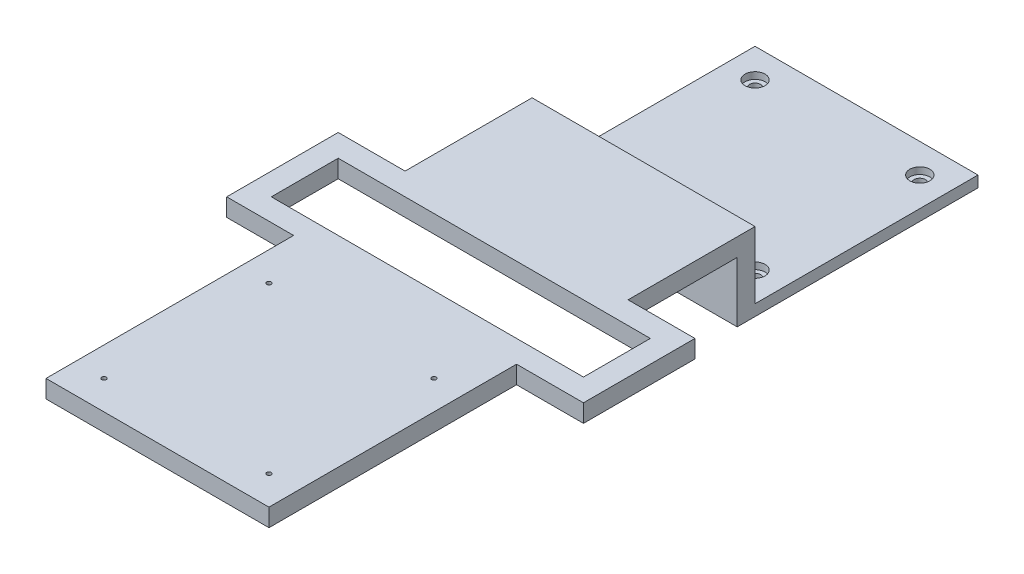
ISO-10303-21;
HEADER;
FILE_DESCRIPTION(('STEP AP214'),'2;1');
FILE_NAME('part.step','',(''),(''),'','','');
FILE_SCHEMA(('AUTOMOTIVE_DESIGN { 1 0 10303 214 1 1 1 1 }'));
ENDSEC;
DATA;
#1=APPLICATION_CONTEXT('core data for automotive mechanical design processes');
#2=APPLICATION_PROTOCOL_DEFINITION('international standard','automotive_design',2000,#1);
#3=PRODUCT_CONTEXT('',#1,'mechanical');
#4=PRODUCT('Part','Part','',(#3));
#5=PRODUCT_RELATED_PRODUCT_CATEGORY('part','',(#4));
#6=PRODUCT_DEFINITION_FORMATION('','',#4);
#7=PRODUCT_DEFINITION_CONTEXT('part definition',#1,'design');
#8=PRODUCT_DEFINITION('design','',#6,#7);
#9=PRODUCT_DEFINITION_SHAPE('','',#8);
#10=(LENGTH_UNIT() NAMED_UNIT(*) SI_UNIT(.MILLI.,.METRE.));
#11=(NAMED_UNIT(*) PLANE_ANGLE_UNIT() SI_UNIT($,.RADIAN.));
#12=(NAMED_UNIT(*) SI_UNIT($,.STERADIAN.) SOLID_ANGLE_UNIT());
#13=UNCERTAINTY_MEASURE_WITH_UNIT(LENGTH_MEASURE(1.E-05),#10,'distance_accuracy_value','');
#14=(GEOMETRIC_REPRESENTATION_CONTEXT(3) GLOBAL_UNCERTAINTY_ASSIGNED_CONTEXT((#13)) GLOBAL_UNIT_ASSIGNED_CONTEXT((#10,
#11,#12)) REPRESENTATION_CONTEXT('',''));
#15=CARTESIAN_POINT('',(0.,0.,0.));
#16=DIRECTION('',(0.,0.,1.));
#17=DIRECTION('',(1.,0.,0.));
#18=AXIS2_PLACEMENT_3D('',#15,#16,#17);
#19=CARTESIAN_POINT('',(50.,5.,-50.));
#20=DIRECTION('',(-1.,0.,0.));
#21=DIRECTION('',(0.,0.,1.));
#22=AXIS2_PLACEMENT_3D('',#19,#20,#21);
#23=PLANE('',#22);
#24=DIRECTION('',(0.,0.,-1.));
#25=VECTOR('',#24,1.);
#26=CARTESIAN_POINT('',(50.,27.,268.));
#27=LINE('',#26,#25);
#28=CARTESIAN_POINT('',(50.,27.,268.));
#29=VERTEX_POINT('',#28);
#30=CARTESIAN_POINT('',(50.,27.,156.95));
#31=VERTEX_POINT('',#30);
#32=EDGE_CURVE('E266',#29,#31,#27,.T.);
#33=ORIENTED_EDGE('',*,*,#32,.T.);
#34=DIRECTION('',(0.,1.,0.));
#35=VECTOR('',#34,1.);
#36=CARTESIAN_POINT('',(50.,5.,156.95));
#37=LINE('',#36,#35);
#38=CARTESIAN_POINT('',(50.,35.,156.95));
#39=VERTEX_POINT('',#38);
#40=EDGE_CURVE('E249',#31,#39,#37,.T.);
#41=ORIENTED_EDGE('',*,*,#40,.T.);
#42=DIRECTION('',(0.,0.,-1.));
#43=VECTOR('',#42,1.);
#44=CARTESIAN_POINT('',(50.,35.,50.));
#45=LINE('',#44,#43);
#46=CARTESIAN_POINT('',(50.,35.,268.));
#47=VERTEX_POINT('',#46);
#48=EDGE_CURVE('E280',#47,#39,#45,.T.);
#49=ORIENTED_EDGE('',*,*,#48,.F.);
#50=DIRECTION('',(0.,1.,0.));
#51=VECTOR('',#50,1.);
#52=CARTESIAN_POINT('',(50.,35.,268.));
#53=LINE('',#52,#51);
#54=EDGE_CURVE('E257',#29,#47,#53,.T.);
#55=ORIENTED_EDGE('',*,*,#54,.F.);
#56=EDGE_LOOP('',(#33,#41,#49,#55));
#57=FACE_BOUND('',#56,.T.);
#58=ADVANCED_FACE('F35',(#57),#23,.F.);
#59=CARTESIAN_POINT('',(-50.,5.,-50.));
#60=DIRECTION('',(1.,0.,0.));
#61=DIRECTION('',(0.,0.,-1.));
#62=AXIS2_PLACEMENT_3D('',#59,#60,#61);
#63=PLANE('',#62);
#64=DIRECTION('',(0.,0.,-1.));
#65=VECTOR('',#64,1.);
#66=CARTESIAN_POINT('',(-50.,35.,50.));
#67=LINE('',#66,#65);
#68=CARTESIAN_POINT('',(-50.,35.,268.));
#69=VERTEX_POINT('',#68);
#70=CARTESIAN_POINT('',(-50.,35.,156.95));
#71=VERTEX_POINT('',#70);
#72=EDGE_CURVE('E276',#69,#71,#67,.T.);
#73=ORIENTED_EDGE('',*,*,#72,.T.);
#74=DIRECTION('',(0.,-1.,0.));
#75=VECTOR('',#74,1.);
#76=CARTESIAN_POINT('',(-50.,5.,156.95));
#77=LINE('',#76,#75);
#78=CARTESIAN_POINT('',(-50.,27.,156.95));
#79=VERTEX_POINT('',#78);
#80=EDGE_CURVE('E246',#71,#79,#77,.T.);
#81=ORIENTED_EDGE('',*,*,#80,.T.);
#82=DIRECTION('',(0.,0.,-1.));
#83=VECTOR('',#82,1.);
#84=CARTESIAN_POINT('',(-50.,27.,268.));
#85=LINE('',#84,#83);
#86=CARTESIAN_POINT('',(-50.,27.,268.));
#87=VERTEX_POINT('',#86);
#88=EDGE_CURVE('E269',#87,#79,#85,.T.);
#89=ORIENTED_EDGE('',*,*,#88,.F.);
#90=DIRECTION('',(0.,-1.,0.));
#91=VECTOR('',#90,1.);
#92=CARTESIAN_POINT('',(-50.,35.,268.));
#93=LINE('',#92,#91);
#94=EDGE_CURVE('E252',#69,#87,#93,.T.);
#95=ORIENTED_EDGE('',*,*,#94,.F.);
#96=EDGE_LOOP('',(#73,#81,#89,#95));
#97=FACE_BOUND('',#96,.T.);
#98=ADVANCED_FACE('F437',(#97),#63,.F.);
#99=CARTESIAN_POINT('',(-36.95,5.,-36.95));
#100=DIRECTION('',(0.,-1.,0.));
#101=DIRECTION('',(0.,0.,-1.));
#102=AXIS2_PLACEMENT_3D('',#99,#100,#101);
#103=CYLINDRICAL_SURFACE('',#102,2.5);
#104=CARTESIAN_POINT('',(-36.95,0.,-36.95));
#105=DIRECTION('',(0.,1.,0.));
#106=DIRECTION('',(0.,0.,1.));
#107=AXIS2_PLACEMENT_3D('',#104,#105,#106);
#108=CIRCLE('',#107,2.5);
#109=CARTESIAN_POINT('',(-36.95,0.,-34.45));
#110=VERTEX_POINT('',#109);
#111=EDGE_CURVE('E331',#110,#110,#108,.T.);
#112=ORIENTED_EDGE('',*,*,#111,.F.);
#113=EDGE_LOOP('',(#112));
#114=FACE_BOUND('',#113,.T.);
#115=CARTESIAN_POINT('',(-36.95,2.,-36.95));
#116=DIRECTION('',(0.,1.,0.));
#117=DIRECTION('',(0.,0.,1.));
#118=AXIS2_PLACEMENT_3D('',#115,#116,#117);
#119=CIRCLE('',#118,2.5);
#120=CARTESIAN_POINT('',(-36.95,2.,-34.45));
#121=VERTEX_POINT('',#120);
#122=EDGE_CURVE('E39',#121,#121,#119,.T.);
#123=ORIENTED_EDGE('',*,*,#122,.T.);
#124=EDGE_LOOP('',(#123));
#125=FACE_BOUND('',#124,.T.);
#126=ADVANCED_FACE('F365',(#114,#125),#103,.F.);
#127=CARTESIAN_POINT('',(36.95,5.,-36.95));
#128=DIRECTION('',(0.,-1.,0.));
#129=DIRECTION('',(0.,0.,-1.));
#130=AXIS2_PLACEMENT_3D('',#127,#128,#129);
#131=CYLINDRICAL_SURFACE('',#130,2.5);
#132=CARTESIAN_POINT('',(36.95,0.,-36.95));
#133=DIRECTION('',(0.,1.,0.));
#134=DIRECTION('',(0.,0.,-1.));
#135=AXIS2_PLACEMENT_3D('',#132,#133,#134);
#136=CIRCLE('',#135,2.5);
#137=CARTESIAN_POINT('',(36.95,0.,-39.45));
#138=VERTEX_POINT('',#137);
#139=EDGE_CURVE('E328',#138,#138,#136,.T.);
#140=ORIENTED_EDGE('',*,*,#139,.F.);
#141=EDGE_LOOP('',(#140));
#142=FACE_BOUND('',#141,.T.);
#143=CARTESIAN_POINT('',(36.95,2.,-36.95));
#144=DIRECTION('',(0.,1.,0.));
#145=DIRECTION('',(0.,0.,1.));
#146=AXIS2_PLACEMENT_3D('',#143,#144,#145);
#147=CIRCLE('',#146,2.5);
#148=CARTESIAN_POINT('',(36.95,2.,-34.45));
#149=VERTEX_POINT('',#148);
#150=EDGE_CURVE('E358',#149,#149,#147,.T.);
#151=ORIENTED_EDGE('',*,*,#150,.T.);
#152=EDGE_LOOP('',(#151));
#153=FACE_BOUND('',#152,.T.);
#154=ADVANCED_FACE('F502',(#142,#153),#131,.F.);
#155=CARTESIAN_POINT('',(36.95,5.,36.95));
#156=DIRECTION('',(0.,-1.,0.));
#157=DIRECTION('',(0.,0.,-1.));
#158=AXIS2_PLACEMENT_3D('',#155,#156,#157);
#159=CYLINDRICAL_SURFACE('',#158,2.5);
#160=CARTESIAN_POINT('',(36.95,0.,36.95));
#161=DIRECTION('',(0.,1.,0.));
#162=DIRECTION('',(0.,0.,1.));
#163=AXIS2_PLACEMENT_3D('',#160,#161,#162);
#164=CIRCLE('',#163,2.5);
#165=CARTESIAN_POINT('',(36.95,0.,39.45));
#166=VERTEX_POINT('',#165);
#167=EDGE_CURVE('E325',#166,#166,#164,.T.);
#168=ORIENTED_EDGE('',*,*,#167,.F.);
#169=EDGE_LOOP('',(#168));
#170=FACE_BOUND('',#169,.T.);
#171=CARTESIAN_POINT('',(36.95,2.,36.95));
#172=DIRECTION('',(0.,1.,0.));
#173=DIRECTION('',(0.,0.,1.));
#174=AXIS2_PLACEMENT_3D('',#171,#172,#173);
#175=CIRCLE('',#174,2.5);
#176=CARTESIAN_POINT('',(36.95,2.,39.45));
#177=VERTEX_POINT('',#176);
#178=EDGE_CURVE('E356',#177,#177,#175,.T.);
#179=ORIENTED_EDGE('',*,*,#178,.T.);
#180=EDGE_LOOP('',(#179));
#181=FACE_BOUND('',#180,.T.);
#182=ADVANCED_FACE('F470',(#170,#181),#159,.F.);
#183=CARTESIAN_POINT('',(-36.95,5.,36.95));
#184=DIRECTION('',(0.,-1.,0.));
#185=DIRECTION('',(0.,0.,-1.));
#186=AXIS2_PLACEMENT_3D('',#183,#184,#185);
#187=CYLINDRICAL_SURFACE('',#186,2.5);
#188=CARTESIAN_POINT('',(-36.95,0.,36.95));
#189=DIRECTION('',(0.,1.,0.));
#190=DIRECTION('',(0.,0.,-1.));
#191=AXIS2_PLACEMENT_3D('',#188,#189,#190);
#192=CIRCLE('',#191,2.5);
#193=CARTESIAN_POINT('',(-36.95,0.,34.45));
#194=VERTEX_POINT('',#193);
#195=EDGE_CURVE('E322',#194,#194,#192,.T.);
#196=ORIENTED_EDGE('',*,*,#195,.F.);
#197=EDGE_LOOP('',(#196));
#198=FACE_BOUND('',#197,.T.);
#199=CARTESIAN_POINT('',(-36.95,2.,36.95));
#200=DIRECTION('',(0.,1.,0.));
#201=DIRECTION('',(0.,0.,1.));
#202=AXIS2_PLACEMENT_3D('',#199,#200,#201);
#203=CIRCLE('',#202,2.5);
#204=CARTESIAN_POINT('',(-36.95,2.,39.45));
#205=VERTEX_POINT('',#204);
#206=EDGE_CURVE('E319',#205,#205,#203,.T.);
#207=ORIENTED_EDGE('',*,*,#206,.T.);
#208=EDGE_LOOP('',(#207));
#209=FACE_BOUND('',#208,.T.);
#210=ADVANCED_FACE('F385',(#198,#209),#187,.F.);
#211=CARTESIAN_POINT('',(0.,5.,0.));
#212=DIRECTION('',(0.,1.,0.));
#213=DIRECTION('',(0.,0.,1.));
#214=AXIS2_PLACEMENT_3D('',#211,#212,#213);
#215=PLANE('',#214);
#216=CARTESIAN_POINT('',(-36.95,5.,-36.95));
#217=DIRECTION('',(0.,1.,0.));
#218=DIRECTION('',(0.,0.,1.));
#219=AXIS2_PLACEMENT_3D('',#216,#217,#218);
#220=CIRCLE('',#219,4.5);
#221=CARTESIAN_POINT('',(-36.95,5.,-32.45));
#222=VERTEX_POINT('',#221);
#223=EDGE_CURVE('E295',#222,#222,#220,.T.);
#224=ORIENTED_EDGE('',*,*,#223,.F.);
#225=EDGE_LOOP('',(#224));
#226=FACE_BOUND('',#225,.T.);
#227=CARTESIAN_POINT('',(36.95,5.,-36.95));
#228=DIRECTION('',(0.,1.,0.));
#229=DIRECTION('',(0.,0.,1.));
#230=AXIS2_PLACEMENT_3D('',#227,#228,#229);
#231=CIRCLE('',#230,4.5);
#232=CARTESIAN_POINT('',(36.95,5.,-32.45));
#233=VERTEX_POINT('',#232);
#234=EDGE_CURVE('E308',#233,#233,#231,.T.);
#235=ORIENTED_EDGE('',*,*,#234,.F.);
#236=EDGE_LOOP('',(#235));
#237=FACE_BOUND('',#236,.T.);
#238=CARTESIAN_POINT('',(36.95,5.,36.95));
#239=DIRECTION('',(0.,1.,0.));
#240=DIRECTION('',(0.,0.,1.));
#241=AXIS2_PLACEMENT_3D('',#238,#239,#240);
#242=CIRCLE('',#241,4.5);
#243=CARTESIAN_POINT('',(36.95,5.,41.45));
#244=VERTEX_POINT('',#243);
#245=EDGE_CURVE('E302',#244,#244,#242,.T.);
#246=ORIENTED_EDGE('',*,*,#245,.F.);
#247=EDGE_LOOP('',(#246));
#248=FACE_BOUND('',#247,.T.);
#249=CARTESIAN_POINT('',(-36.95,5.,36.95));
#250=DIRECTION('',(0.,1.,0.));
#251=DIRECTION('',(0.,0.,1.));
#252=AXIS2_PLACEMENT_3D('',#249,#250,#251);
#253=CIRCLE('',#252,4.5);
#254=CARTESIAN_POINT('',(-36.95,5.,41.45));
#255=VERTEX_POINT('',#254);
#256=EDGE_CURVE('E301',#255,#255,#253,.T.);
#257=ORIENTED_EDGE('',*,*,#256,.F.);
#258=EDGE_LOOP('',(#257));
#259=FACE_BOUND('',#258,.T.);
#260=DIRECTION('',(0.,0.,-1.));
#261=VECTOR('',#260,1.);
#262=CARTESIAN_POINT('',(50.,5.,-50.));
#263=LINE('',#262,#261);
#264=CARTESIAN_POINT('',(50.,5.,50.));
#265=VERTEX_POINT('',#264);
#266=CARTESIAN_POINT('',(50.,5.,-50.));
#267=VERTEX_POINT('',#266);
#268=EDGE_CURVE('E335',#265,#267,#263,.T.);
#269=ORIENTED_EDGE('',*,*,#268,.T.);
#270=DIRECTION('',(-1.,0.,0.));
#271=VECTOR('',#270,1.);
#272=CARTESIAN_POINT('',(-50.,5.,-50.));
#273=LINE('',#272,#271);
#274=CARTESIAN_POINT('',(-50.,5.,-50.));
#275=VERTEX_POINT('',#274);
#276=EDGE_CURVE('E338',#267,#275,#273,.T.);
#277=ORIENTED_EDGE('',*,*,#276,.T.);
#278=DIRECTION('',(0.,0.,1.));
#279=VECTOR('',#278,1.);
#280=CARTESIAN_POINT('',(-50.,5.,-50.));
#281=LINE('',#280,#279);
#282=CARTESIAN_POINT('',(-50.,5.,50.));
#283=VERTEX_POINT('',#282);
#284=EDGE_CURVE('E341',#275,#283,#281,.T.);
#285=ORIENTED_EDGE('',*,*,#284,.T.);
#286=DIRECTION('',(1.,0.,0.));
#287=VECTOR('',#286,1.);
#288=CARTESIAN_POINT('',(-50.,5.,50.));
#289=LINE('',#288,#287);
#290=EDGE_CURVE('E344',#283,#265,#289,.T.);
#291=ORIENTED_EDGE('',*,*,#290,.T.);
#292=EDGE_LOOP('',(#269,#277,#285,#291));
#293=FACE_BOUND('',#292,.T.);
#294=ADVANCED_FACE('F381',(#226,#237,#248,#259,#293),#215,.T.);
#295=CARTESIAN_POINT('',(0.,0.,0.));
#296=DIRECTION('',(0.,1.,0.));
#297=DIRECTION('',(0.,0.,1.));
#298=AXIS2_PLACEMENT_3D('',#295,#296,#297);
#299=PLANE('',#298);
#300=DIRECTION('',(0.,0.,-1.));
#301=VECTOR('',#300,1.);
#302=CARTESIAN_POINT('',(50.,0.,-50.));
#303=LINE('',#302,#301);
#304=CARTESIAN_POINT('',(50.,0.,58.));
#305=VERTEX_POINT('',#304);
#306=CARTESIAN_POINT('',(50.,0.,-50.));
#307=VERTEX_POINT('',#306);
#308=EDGE_CURVE('E334',#305,#307,#303,.T.);
#309=ORIENTED_EDGE('',*,*,#308,.F.);
#310=DIRECTION('',(-1.,0.,0.));
#311=VECTOR('',#310,1.);
#312=CARTESIAN_POINT('',(50.,0.,58.));
#313=LINE('',#312,#311);
#314=CARTESIAN_POINT('',(-50.,0.,58.));
#315=VERTEX_POINT('',#314);
#316=EDGE_CURVE('E283',#305,#315,#313,.T.);
#317=ORIENTED_EDGE('',*,*,#316,.T.);
#318=DIRECTION('',(0.,0.,1.));
#319=VECTOR('',#318,1.);
#320=CARTESIAN_POINT('',(-50.,0.,-50.));
#321=LINE('',#320,#319);
#322=CARTESIAN_POINT('',(-50.,0.,-50.));
#323=VERTEX_POINT('',#322);
#324=EDGE_CURVE('E339',#323,#315,#321,.T.);
#325=ORIENTED_EDGE('',*,*,#324,.F.);
#326=DIRECTION('',(-1.,0.,0.));
#327=VECTOR('',#326,1.);
#328=CARTESIAN_POINT('',(-50.,0.,-50.));
#329=LINE('',#328,#327);
#330=EDGE_CURVE('E349',#307,#323,#329,.T.);
#331=ORIENTED_EDGE('',*,*,#330,.F.);
#332=EDGE_LOOP('',(#309,#317,#325,#331));
#333=FACE_BOUND('',#332,.T.);
#334=ORIENTED_EDGE('',*,*,#111,.T.);
#335=EDGE_LOOP('',(#334));
#336=FACE_BOUND('',#335,.T.);
#337=ORIENTED_EDGE('',*,*,#139,.T.);
#338=EDGE_LOOP('',(#337));
#339=FACE_BOUND('',#338,.T.);
#340=ORIENTED_EDGE('',*,*,#167,.T.);
#341=EDGE_LOOP('',(#340));
#342=FACE_BOUND('',#341,.T.);
#343=ORIENTED_EDGE('',*,*,#195,.T.);
#344=EDGE_LOOP('',(#343));
#345=FACE_BOUND('',#344,.T.);
#346=ADVANCED_FACE('F384',(#333,#336,#339,#342,#345),#299,.F.);
#347=CARTESIAN_POINT('',(50.,35.,106.95));
#348=VERTEX_POINT('',#347);
#349=CARTESIAN_POINT('',(50.,35.,50.));
#350=VERTEX_POINT('',#349);
#351=EDGE_CURVE('E279',#348,#350,#45,.T.);
#352=ORIENTED_EDGE('',*,*,#351,.F.);
#353=DIRECTION('',(0.,-1.,0.));
#354=VECTOR('',#353,1.);
#355=CARTESIAN_POINT('',(50.,5.,106.95));
#356=LINE('',#355,#354);
#357=CARTESIAN_POINT('',(50.,27.,106.95));
#358=VERTEX_POINT('',#357);
#359=EDGE_CURVE('E243',#348,#358,#356,.T.);
#360=ORIENTED_EDGE('',*,*,#359,.T.);
#361=CARTESIAN_POINT('',(50.,27.,58.));
#362=VERTEX_POINT('',#361);
#363=EDGE_CURVE('E263',#358,#362,#27,.T.);
#364=ORIENTED_EDGE('',*,*,#363,.T.);
#365=DIRECTION('',(0.,1.,0.));
#366=VECTOR('',#365,1.);
#367=CARTESIAN_POINT('',(50.,0.,58.));
#368=LINE('',#367,#366);
#369=EDGE_CURVE('E275',#305,#362,#368,.T.);
#370=ORIENTED_EDGE('',*,*,#369,.F.);
#371=ORIENTED_EDGE('',*,*,#308,.T.);
#372=DIRECTION('',(0.,-1.,0.));
#373=VECTOR('',#372,1.);
#374=CARTESIAN_POINT('',(50.,5.,-50.));
#375=LINE('',#374,#373);
#376=EDGE_CURVE('E11',#267,#307,#375,.T.);
#377=ORIENTED_EDGE('',*,*,#376,.F.);
#378=ORIENTED_EDGE('',*,*,#268,.F.);
#379=DIRECTION('',(0.,-1.,0.));
#380=VECTOR('',#379,1.);
#381=CARTESIAN_POINT('',(50.,0.,50.));
#382=LINE('',#381,#380);
#383=EDGE_CURVE('E273',#350,#265,#382,.T.);
#384=ORIENTED_EDGE('',*,*,#383,.F.);
#385=EDGE_LOOP('',(#352,#360,#364,#370,#371,#377,#378,#384));
#386=FACE_BOUND('',#385,.T.);
#387=ADVANCED_FACE('F37',(#386),#23,.F.);
#388=CARTESIAN_POINT('',(-50.,5.,-50.));
#389=DIRECTION('',(0.,0.,1.));
#390=DIRECTION('',(1.,0.,0.));
#391=AXIS2_PLACEMENT_3D('',#388,#389,#390);
#392=PLANE('',#391);
#393=ORIENTED_EDGE('',*,*,#330,.T.);
#394=DIRECTION('',(0.,-1.,0.));
#395=VECTOR('',#394,1.);
#396=CARTESIAN_POINT('',(-50.,5.,-50.));
#397=LINE('',#396,#395);
#398=EDGE_CURVE('E44',#275,#323,#397,.T.);
#399=ORIENTED_EDGE('',*,*,#398,.F.);
#400=ORIENTED_EDGE('',*,*,#276,.F.);
#401=ORIENTED_EDGE('',*,*,#376,.T.);
#402=EDGE_LOOP('',(#393,#399,#400,#401));
#403=FACE_BOUND('',#402,.T.);
#404=ADVANCED_FACE('F400',(#403),#392,.F.);
#405=CARTESIAN_POINT('',(-50.,27.,106.95));
#406=VERTEX_POINT('',#405);
#407=CARTESIAN_POINT('',(-50.,27.,58.));
#408=VERTEX_POINT('',#407);
#409=EDGE_CURVE('E268',#406,#408,#85,.T.);
#410=ORIENTED_EDGE('',*,*,#409,.F.);
#411=DIRECTION('',(0.,1.,0.));
#412=VECTOR('',#411,1.);
#413=CARTESIAN_POINT('',(-50.,5.,106.95));
#414=LINE('',#413,#412);
#415=CARTESIAN_POINT('',(-50.,35.,106.95));
#416=VERTEX_POINT('',#415);
#417=EDGE_CURVE('E240',#406,#416,#414,.T.);
#418=ORIENTED_EDGE('',*,*,#417,.T.);
#419=CARTESIAN_POINT('',(-50.,35.,50.));
#420=VERTEX_POINT('',#419);
#421=EDGE_CURVE('E289',#416,#420,#67,.T.);
#422=ORIENTED_EDGE('',*,*,#421,.T.);
#423=DIRECTION('',(0.,-1.,0.));
#424=VECTOR('',#423,1.);
#425=CARTESIAN_POINT('',(-50.,0.,50.));
#426=LINE('',#425,#424);
#427=EDGE_CURVE('E272',#420,#283,#426,.T.);
#428=ORIENTED_EDGE('',*,*,#427,.T.);
#429=ORIENTED_EDGE('',*,*,#284,.F.);
#430=ORIENTED_EDGE('',*,*,#398,.T.);
#431=ORIENTED_EDGE('',*,*,#324,.T.);
#432=DIRECTION('',(0.,1.,0.));
#433=VECTOR('',#432,1.);
#434=CARTESIAN_POINT('',(-50.,0.,58.));
#435=LINE('',#434,#433);
#436=EDGE_CURVE('E286',#315,#408,#435,.T.);
#437=ORIENTED_EDGE('',*,*,#436,.T.);
#438=EDGE_LOOP('',(#410,#418,#422,#428,#429,#430,#431,#437));
#439=FACE_BOUND('',#438,.T.);
#440=ADVANCED_FACE('F405',(#439),#63,.F.);
#441=CARTESIAN_POINT('',(-36.95,2.,36.95));
#442=DIRECTION('',(0.,1.,0.));
#443=DIRECTION('',(0.,0.,1.));
#444=AXIS2_PLACEMENT_3D('',#441,#442,#443);
#445=CYLINDRICAL_SURFACE('',#444,4.5);
#446=CARTESIAN_POINT('',(-36.95,2.,36.95));
#447=DIRECTION('',(0.,1.,0.));
#448=DIRECTION('',(0.,0.,1.));
#449=AXIS2_PLACEMENT_3D('',#446,#447,#448);
#450=CIRCLE('',#449,4.5);
#451=CARTESIAN_POINT('',(-36.95,2.,41.45));
#452=VERTEX_POINT('',#451);
#453=EDGE_CURVE('E316',#452,#452,#450,.T.);
#454=ORIENTED_EDGE('',*,*,#453,.F.);
#455=EDGE_LOOP('',(#454));
#456=FACE_BOUND('',#455,.T.);
#457=ORIENTED_EDGE('',*,*,#256,.T.);
#458=EDGE_LOOP('',(#457));
#459=FACE_BOUND('',#458,.T.);
#460=ADVANCED_FACE('F478',(#456,#459),#445,.F.);
#461=CARTESIAN_POINT('',(-36.95,2.,36.95));
#462=DIRECTION('',(0.,1.,0.));
#463=DIRECTION('',(0.,0.,1.));
#464=AXIS2_PLACEMENT_3D('',#461,#462,#463);
#465=PLANE('',#464);
#466=ORIENTED_EDGE('',*,*,#206,.F.);
#467=EDGE_LOOP('',(#466));
#468=FACE_BOUND('',#467,.T.);
#469=ORIENTED_EDGE('',*,*,#453,.T.);
#470=EDGE_LOOP('',(#469));
#471=FACE_BOUND('',#470,.T.);
#472=ADVANCED_FACE('F474',(#468,#471),#465,.T.);
#473=CARTESIAN_POINT('',(36.95,2.,36.95));
#474=DIRECTION('',(0.,1.,0.));
#475=DIRECTION('',(0.,0.,1.));
#476=AXIS2_PLACEMENT_3D('',#473,#474,#475);
#477=CYLINDRICAL_SURFACE('',#476,4.5);
#478=CARTESIAN_POINT('',(36.95,2.,36.95));
#479=DIRECTION('',(0.,1.,0.));
#480=DIRECTION('',(0.,0.,1.));
#481=AXIS2_PLACEMENT_3D('',#478,#479,#480);
#482=CIRCLE('',#481,4.5);
#483=CARTESIAN_POINT('',(36.95,2.,41.45));
#484=VERTEX_POINT('',#483);
#485=EDGE_CURVE('E298',#484,#484,#482,.T.);
#486=ORIENTED_EDGE('',*,*,#485,.F.);
#487=EDGE_LOOP('',(#486));
#488=FACE_BOUND('',#487,.T.);
#489=ORIENTED_EDGE('',*,*,#245,.T.);
#490=EDGE_LOOP('',(#489));
#491=FACE_BOUND('',#490,.T.);
#492=ADVANCED_FACE('F477',(#488,#491),#477,.F.);
#493=CARTESIAN_POINT('',(36.95,2.,36.95));
#494=DIRECTION('',(0.,1.,0.));
#495=DIRECTION('',(0.,0.,1.));
#496=AXIS2_PLACEMENT_3D('',#493,#494,#495);
#497=PLANE('',#496);
#498=ORIENTED_EDGE('',*,*,#178,.F.);
#499=EDGE_LOOP('',(#498));
#500=FACE_BOUND('',#499,.T.);
#501=ORIENTED_EDGE('',*,*,#485,.T.);
#502=EDGE_LOOP('',(#501));
#503=FACE_BOUND('',#502,.T.);
#504=ADVANCED_FACE('F514',(#500,#503),#497,.T.);
#505=CARTESIAN_POINT('',(36.95,2.,-36.95));
#506=DIRECTION('',(0.,1.,0.));
#507=DIRECTION('',(0.,0.,1.));
#508=AXIS2_PLACEMENT_3D('',#505,#506,#507);
#509=CYLINDRICAL_SURFACE('',#508,4.5);
#510=CARTESIAN_POINT('',(36.95,2.,-36.95));
#511=DIRECTION('',(0.,1.,0.));
#512=DIRECTION('',(0.,0.,1.));
#513=AXIS2_PLACEMENT_3D('',#510,#511,#512);
#514=CIRCLE('',#513,4.5);
#515=CARTESIAN_POINT('',(36.95,2.,-32.45));
#516=VERTEX_POINT('',#515);
#517=EDGE_CURVE('E305',#516,#516,#514,.T.);
#518=ORIENTED_EDGE('',*,*,#517,.F.);
#519=EDGE_LOOP('',(#518));
#520=FACE_BOUND('',#519,.T.);
#521=ORIENTED_EDGE('',*,*,#234,.T.);
#522=EDGE_LOOP('',(#521));
#523=FACE_BOUND('',#522,.T.);
#524=ADVANCED_FACE('F517',(#520,#523),#509,.F.);
#525=CARTESIAN_POINT('',(36.95,2.,-36.95));
#526=DIRECTION('',(0.,1.,0.));
#527=DIRECTION('',(0.,0.,1.));
#528=AXIS2_PLACEMENT_3D('',#525,#526,#527);
#529=PLANE('',#528);
#530=ORIENTED_EDGE('',*,*,#150,.F.);
#531=EDGE_LOOP('',(#530));
#532=FACE_BOUND('',#531,.T.);
#533=ORIENTED_EDGE('',*,*,#517,.T.);
#534=EDGE_LOOP('',(#533));
#535=FACE_BOUND('',#534,.T.);
#536=ADVANCED_FACE('F377',(#532,#535),#529,.T.);
#537=CARTESIAN_POINT('',(-36.95,2.,-36.95));
#538=DIRECTION('',(0.,1.,0.));
#539=DIRECTION('',(0.,0.,1.));
#540=AXIS2_PLACEMENT_3D('',#537,#538,#539);
#541=CYLINDRICAL_SURFACE('',#540,4.5);
#542=CARTESIAN_POINT('',(-36.95,2.,-36.95));
#543=DIRECTION('',(0.,1.,0.));
#544=DIRECTION('',(0.,0.,1.));
#545=AXIS2_PLACEMENT_3D('',#542,#543,#544);
#546=CIRCLE('',#545,4.5);
#547=CARTESIAN_POINT('',(-36.95,2.,-32.45));
#548=VERTEX_POINT('',#547);
#549=EDGE_CURVE('E311',#548,#548,#546,.T.);
#550=ORIENTED_EDGE('',*,*,#549,.F.);
#551=EDGE_LOOP('',(#550));
#552=FACE_BOUND('',#551,.T.);
#553=ORIENTED_EDGE('',*,*,#223,.T.);
#554=EDGE_LOOP('',(#553));
#555=FACE_BOUND('',#554,.T.);
#556=ADVANCED_FACE('F371',(#552,#555),#541,.F.);
#557=CARTESIAN_POINT('',(-36.95,2.,-36.95));
#558=DIRECTION('',(0.,1.,0.));
#559=DIRECTION('',(0.,0.,1.));
#560=AXIS2_PLACEMENT_3D('',#557,#558,#559);
#561=PLANE('',#560);
#562=ORIENTED_EDGE('',*,*,#122,.F.);
#563=EDGE_LOOP('',(#562));
#564=FACE_BOUND('',#563,.T.);
#565=ORIENTED_EDGE('',*,*,#549,.T.);
#566=EDGE_LOOP('',(#565));
#567=FACE_BOUND('',#566,.T.);
#568=ADVANCED_FACE('F367',(#564,#567),#561,.T.);
#569=CARTESIAN_POINT('',(50.,0.,50.));
#570=DIRECTION('',(0.,0.,-1.));
#571=DIRECTION('',(-1.,0.,0.));
#572=AXIS2_PLACEMENT_3D('',#569,#570,#571);
#573=PLANE('',#572);
#574=ORIENTED_EDGE('',*,*,#290,.F.);
#575=ORIENTED_EDGE('',*,*,#427,.F.);
#576=DIRECTION('',(-1.,0.,0.));
#577=VECTOR('',#576,1.);
#578=CARTESIAN_POINT('',(50.,35.,50.));
#579=LINE('',#578,#577);
#580=EDGE_CURVE('E292',#350,#420,#579,.T.);
#581=ORIENTED_EDGE('',*,*,#580,.F.);
#582=ORIENTED_EDGE('',*,*,#383,.T.);
#583=EDGE_LOOP('',(#574,#575,#581,#582));
#584=FACE_BOUND('',#583,.T.);
#585=ADVANCED_FACE('F370',(#584),#573,.T.);
#586=CARTESIAN_POINT('',(50.,35.,50.));
#587=DIRECTION('',(0.,1.,0.));
#588=DIRECTION('',(0.,0.,1.));
#589=AXIS2_PLACEMENT_3D('',#586,#587,#588);
#590=PLANE('',#589);
#591=CARTESIAN_POINT('',(-37.,35.,255.));
#592=DIRECTION('',(0.,1.,0.));
#593=DIRECTION('',(0.,0.,-1.));
#594=AXIS2_PLACEMENT_3D('',#591,#592,#593);
#595=CIRCLE('',#594,0.999999999999998);
#596=CARTESIAN_POINT('',(-37.,35.,254.));
#597=VERTEX_POINT('',#596);
#598=EDGE_CURVE('E842',#597,#597,#595,.T.);
#599=ORIENTED_EDGE('',*,*,#598,.F.);
#600=EDGE_LOOP('',(#599));
#601=FACE_BOUND('',#600,.T.);
#602=CARTESIAN_POINT('',(37.,35.,255.));
#603=DIRECTION('',(0.,1.,0.));
#604=DIRECTION('',(0.,0.,1.));
#605=AXIS2_PLACEMENT_3D('',#602,#603,#604);
#606=CIRCLE('',#605,0.999999999999998);
#607=CARTESIAN_POINT('',(37.,35.,256.));
#608=VERTEX_POINT('',#607);
#609=EDGE_CURVE('E844',#608,#608,#606,.T.);
#610=ORIENTED_EDGE('',*,*,#609,.F.);
#611=EDGE_LOOP('',(#610));
#612=FACE_BOUND('',#611,.T.);
#613=CARTESIAN_POINT('',(37.,35.,181.));
#614=DIRECTION('',(0.,1.,0.));
#615=DIRECTION('',(0.,0.,-1.));
#616=AXIS2_PLACEMENT_3D('',#613,#614,#615);
#617=CIRCLE('',#616,0.999999999999998);
#618=CARTESIAN_POINT('',(37.,35.,180.));
#619=VERTEX_POINT('',#618);
#620=EDGE_CURVE('E870',#619,#619,#617,.T.);
#621=ORIENTED_EDGE('',*,*,#620,.F.);
#622=EDGE_LOOP('',(#621));
#623=FACE_BOUND('',#622,.T.);
#624=CARTESIAN_POINT('',(-37.,35.,181.));
#625=DIRECTION('',(0.,1.,0.));
#626=DIRECTION('',(0.,0.,1.));
#627=AXIS2_PLACEMENT_3D('',#624,#625,#626);
#628=CIRCLE('',#627,0.999999999999998);
#629=CARTESIAN_POINT('',(-37.,35.,182.));
#630=VERTEX_POINT('',#629);
#631=EDGE_CURVE('E850',#630,#630,#628,.T.);
#632=ORIENTED_EDGE('',*,*,#631,.F.);
#633=EDGE_LOOP('',(#632));
#634=FACE_BOUND('',#633,.T.);
#635=DIRECTION('',(0.,0.,-1.));
#636=VECTOR('',#635,1.);
#637=CARTESIAN_POINT('',(70.,35.,116.95));
#638=LINE('',#637,#636);
#639=CARTESIAN_POINT('',(70.,35.,146.95));
#640=VERTEX_POINT('',#639);
#641=CARTESIAN_POINT('',(70.,35.,116.95));
#642=VERTEX_POINT('',#641);
#643=EDGE_CURVE('E52',#640,#642,#638,.T.);
#644=ORIENTED_EDGE('',*,*,#643,.F.);
#645=DIRECTION('',(1.,0.,0.));
#646=VECTOR('',#645,1.);
#647=CARTESIAN_POINT('',(-70.,35.,146.95));
#648=LINE('',#647,#646);
#649=CARTESIAN_POINT('',(-70.,35.,146.95));
#650=VERTEX_POINT('',#649);
#651=EDGE_CURVE('E193',#650,#640,#648,.T.);
#652=ORIENTED_EDGE('',*,*,#651,.F.);
#653=DIRECTION('',(0.,0.,1.));
#654=VECTOR('',#653,1.);
#655=CARTESIAN_POINT('',(-70.,35.,116.95));
#656=LINE('',#655,#654);
#657=CARTESIAN_POINT('',(-70.,35.,116.95));
#658=VERTEX_POINT('',#657);
#659=EDGE_CURVE('E177',#658,#650,#656,.T.);
#660=ORIENTED_EDGE('',*,*,#659,.F.);
#661=DIRECTION('',(-1.,0.,0.));
#662=VECTOR('',#661,1.);
#663=CARTESIAN_POINT('',(-70.,35.,116.95));
#664=LINE('',#663,#662);
#665=EDGE_CURVE('E186',#642,#658,#664,.T.);
#666=ORIENTED_EDGE('',*,*,#665,.F.);
#667=EDGE_LOOP('',(#644,#652,#660,#666));
#668=FACE_BOUND('',#667,.T.);
#669=ORIENTED_EDGE('',*,*,#421,.F.);
#670=DIRECTION('',(-1.,0.,0.));
#671=VECTOR('',#670,1.);
#672=CARTESIAN_POINT('',(-80.,35.,106.95));
#673=LINE('',#672,#671);
#674=CARTESIAN_POINT('',(-80.,35.,106.95));
#675=VERTEX_POINT('',#674);
#676=EDGE_CURVE('E218',#416,#675,#673,.T.);
#677=ORIENTED_EDGE('',*,*,#676,.T.);
#678=DIRECTION('',(0.,0.,1.));
#679=VECTOR('',#678,1.);
#680=CARTESIAN_POINT('',(-80.,35.,106.95));
#681=LINE('',#680,#679);
#682=CARTESIAN_POINT('',(-80.,35.,156.95));
#683=VERTEX_POINT('',#682);
#684=EDGE_CURVE('E222',#675,#683,#681,.T.);
#685=ORIENTED_EDGE('',*,*,#684,.T.);
#686=DIRECTION('',(1.,0.,0.));
#687=VECTOR('',#686,1.);
#688=CARTESIAN_POINT('',(-80.,35.,156.95));
#689=LINE('',#688,#687);
#690=EDGE_CURVE('E226',#683,#71,#689,.T.);
#691=ORIENTED_EDGE('',*,*,#690,.T.);
#692=ORIENTED_EDGE('',*,*,#72,.F.);
#693=DIRECTION('',(-1.,0.,0.));
#694=VECTOR('',#693,1.);
#695=CARTESIAN_POINT('',(-50.,35.,268.));
#696=LINE('',#695,#694);
#697=EDGE_CURVE('E260',#47,#69,#696,.T.);
#698=ORIENTED_EDGE('',*,*,#697,.F.);
#699=ORIENTED_EDGE('',*,*,#48,.T.);
#700=CARTESIAN_POINT('',(80.,35.,156.95));
#701=VERTEX_POINT('',#700);
#702=EDGE_CURVE('E225',#39,#701,#689,.T.);
#703=ORIENTED_EDGE('',*,*,#702,.T.);
#704=DIRECTION('',(0.,0.,-1.));
#705=VECTOR('',#704,1.);
#706=CARTESIAN_POINT('',(80.,35.,106.95));
#707=LINE('',#706,#705);
#708=CARTESIAN_POINT('',(80.,35.,106.95));
#709=VERTEX_POINT('',#708);
#710=EDGE_CURVE('E204',#701,#709,#707,.T.);
#711=ORIENTED_EDGE('',*,*,#710,.T.);
#712=EDGE_CURVE('E219',#709,#348,#673,.T.);
#713=ORIENTED_EDGE('',*,*,#712,.T.);
#714=ORIENTED_EDGE('',*,*,#351,.T.);
#715=ORIENTED_EDGE('',*,*,#580,.T.);
#716=EDGE_LOOP('',(#669,#677,#685,#691,#692,#698,#699,#703,#711,#713,#714,#715));
#717=FACE_BOUND('',#716,.T.);
#718=ADVANCED_FACE('F190',(#601,#612,#623,#634,#668,#717),#590,.T.);
#719=CARTESIAN_POINT('',(50.,0.,58.));
#720=DIRECTION('',(0.,0.,1.));
#721=DIRECTION('',(1.,0.,0.));
#722=AXIS2_PLACEMENT_3D('',#719,#720,#721);
#723=PLANE('',#722);
#724=DIRECTION('',(1.,0.,0.));
#725=VECTOR('',#724,1.);
#726=CARTESIAN_POINT('',(-50.,27.,58.));
#727=LINE('',#726,#725);
#728=EDGE_CURVE('E251',#408,#362,#727,.T.);
#729=ORIENTED_EDGE('',*,*,#728,.F.);
#730=ORIENTED_EDGE('',*,*,#436,.F.);
#731=ORIENTED_EDGE('',*,*,#316,.F.);
#732=ORIENTED_EDGE('',*,*,#369,.T.);
#733=EDGE_LOOP('',(#729,#730,#731,#732));
#734=FACE_BOUND('',#733,.T.);
#735=ADVANCED_FACE('F454',(#734),#723,.T.);
#736=CARTESIAN_POINT('',(-50.,27.,268.));
#737=DIRECTION('',(0.,1.,0.));
#738=DIRECTION('',(0.,0.,1.));
#739=AXIS2_PLACEMENT_3D('',#736,#737,#738);
#740=PLANE('',#739);
#741=CARTESIAN_POINT('',(-37.,27.,255.));
#742=DIRECTION('',(0.,1.,0.));
#743=DIRECTION('',(0.,0.,1.));
#744=AXIS2_PLACEMENT_3D('',#741,#742,#743);
#745=CIRCLE('',#744,0.999999999999998);
#746=CARTESIAN_POINT('',(-37.,27.,256.));
#747=VERTEX_POINT('',#746);
#748=EDGE_CURVE('E839',#747,#747,#745,.F.);
#749=ORIENTED_EDGE('',*,*,#748,.F.);
#750=EDGE_LOOP('',(#749));
#751=FACE_BOUND('',#750,.T.);
#752=CARTESIAN_POINT('',(37.,27.,255.));
#753=DIRECTION('',(0.,1.,0.));
#754=DIRECTION('',(0.,0.,1.));
#755=AXIS2_PLACEMENT_3D('',#752,#753,#754);
#756=CIRCLE('',#755,0.999999999999998);
#757=CARTESIAN_POINT('',(37.,27.,256.));
#758=VERTEX_POINT('',#757);
#759=EDGE_CURVE('E847',#758,#758,#756,.F.);
#760=ORIENTED_EDGE('',*,*,#759,.F.);
#761=EDGE_LOOP('',(#760));
#762=FACE_BOUND('',#761,.T.);
#763=CARTESIAN_POINT('',(37.,27.,181.));
#764=DIRECTION('',(0.,1.,0.));
#765=DIRECTION('',(0.,0.,1.));
#766=AXIS2_PLACEMENT_3D('',#763,#764,#765);
#767=CIRCLE('',#766,0.999999999999998);
#768=CARTESIAN_POINT('',(37.,27.,182.));
#769=VERTEX_POINT('',#768);
#770=EDGE_CURVE('E854',#769,#769,#767,.F.);
#771=ORIENTED_EDGE('',*,*,#770,.F.);
#772=EDGE_LOOP('',(#771));
#773=FACE_BOUND('',#772,.T.);
#774=CARTESIAN_POINT('',(-37.,27.,181.));
#775=DIRECTION('',(0.,1.,0.));
#776=DIRECTION('',(0.,0.,1.));
#777=AXIS2_PLACEMENT_3D('',#774,#775,#776);
#778=CIRCLE('',#777,0.999999999999998);
#779=CARTESIAN_POINT('',(-37.,27.,182.));
#780=VERTEX_POINT('',#779);
#781=EDGE_CURVE('E853',#780,#780,#778,.F.);
#782=ORIENTED_EDGE('',*,*,#781,.F.);
#783=EDGE_LOOP('',(#782));
#784=FACE_BOUND('',#783,.T.);
#785=DIRECTION('',(-1.,0.,0.));
#786=VECTOR('',#785,1.);
#787=CARTESIAN_POINT('',(-70.,27.,146.95));
#788=LINE('',#787,#786);
#789=CARTESIAN_POINT('',(70.,27.,146.95));
#790=VERTEX_POINT('',#789);
#791=CARTESIAN_POINT('',(-70.,27.,146.95));
#792=VERTEX_POINT('',#791);
#793=EDGE_CURVE('E858',#790,#792,#788,.T.);
#794=ORIENTED_EDGE('',*,*,#793,.F.);
#795=DIRECTION('',(0.,0.,1.));
#796=VECTOR('',#795,1.);
#797=CARTESIAN_POINT('',(70.,27.,116.95));
#798=LINE('',#797,#796);
#799=CARTESIAN_POINT('',(70.,27.,116.95));
#800=VERTEX_POINT('',#799);
#801=EDGE_CURVE('E205',#800,#790,#798,.T.);
#802=ORIENTED_EDGE('',*,*,#801,.F.);
#803=DIRECTION('',(1.,0.,0.));
#804=VECTOR('',#803,1.);
#805=CARTESIAN_POINT('',(-70.,27.,116.95));
#806=LINE('',#805,#804);
#807=CARTESIAN_POINT('',(-70.,27.,116.95));
#808=VERTEX_POINT('',#807);
#809=EDGE_CURVE('E202',#808,#800,#806,.T.);
#810=ORIENTED_EDGE('',*,*,#809,.F.);
#811=DIRECTION('',(0.,0.,-1.));
#812=VECTOR('',#811,1.);
#813=CARTESIAN_POINT('',(-70.,27.,116.95));
#814=LINE('',#813,#812);
#815=EDGE_CURVE('E180',#792,#808,#814,.T.);
#816=ORIENTED_EDGE('',*,*,#815,.F.);
#817=EDGE_LOOP('',(#794,#802,#810,#816));
#818=FACE_BOUND('',#817,.T.);
#819=ORIENTED_EDGE('',*,*,#363,.F.);
#820=DIRECTION('',(1.,0.,0.));
#821=VECTOR('',#820,1.);
#822=CARTESIAN_POINT('',(-80.,27.,106.95));
#823=LINE('',#822,#821);
#824=CARTESIAN_POINT('',(80.,27.,106.95));
#825=VERTEX_POINT('',#824);
#826=EDGE_CURVE('E215',#358,#825,#823,.T.);
#827=ORIENTED_EDGE('',*,*,#826,.T.);
#828=DIRECTION('',(0.,0.,1.));
#829=VECTOR('',#828,1.);
#830=CARTESIAN_POINT('',(80.,27.,106.95));
#831=LINE('',#830,#829);
#832=CARTESIAN_POINT('',(80.,27.,156.95));
#833=VERTEX_POINT('',#832);
#834=EDGE_CURVE('E213',#825,#833,#831,.T.);
#835=ORIENTED_EDGE('',*,*,#834,.T.);
#836=DIRECTION('',(-1.,0.,0.));
#837=VECTOR('',#836,1.);
#838=CARTESIAN_POINT('',(-80.,27.,156.95));
#839=LINE('',#838,#837);
#840=EDGE_CURVE('E210',#833,#31,#839,.T.);
#841=ORIENTED_EDGE('',*,*,#840,.T.);
#842=ORIENTED_EDGE('',*,*,#32,.F.);
#843=DIRECTION('',(1.,0.,0.));
#844=VECTOR('',#843,1.);
#845=CARTESIAN_POINT('',(-50.,27.,268.));
#846=LINE('',#845,#844);
#847=EDGE_CURVE('E255',#87,#29,#846,.T.);
#848=ORIENTED_EDGE('',*,*,#847,.F.);
#849=ORIENTED_EDGE('',*,*,#88,.T.);
#850=CARTESIAN_POINT('',(-80.,27.,156.95));
#851=VERTEX_POINT('',#850);
#852=EDGE_CURVE('E208',#79,#851,#839,.T.);
#853=ORIENTED_EDGE('',*,*,#852,.T.);
#854=DIRECTION('',(0.,0.,-1.));
#855=VECTOR('',#854,1.);
#856=CARTESIAN_POINT('',(-80.,27.,106.95));
#857=LINE('',#856,#855);
#858=CARTESIAN_POINT('',(-80.,27.,106.95));
#859=VERTEX_POINT('',#858);
#860=EDGE_CURVE('E206',#851,#859,#857,.T.);
#861=ORIENTED_EDGE('',*,*,#860,.T.);
#862=EDGE_CURVE('E238',#859,#406,#823,.T.);
#863=ORIENTED_EDGE('',*,*,#862,.T.);
#864=ORIENTED_EDGE('',*,*,#409,.T.);
#865=ORIENTED_EDGE('',*,*,#728,.T.);
#866=EDGE_LOOP('',(#819,#827,#835,#841,#842,#848,#849,#853,#861,#863,#864,#865));
#867=FACE_BOUND('',#866,.T.);
#868=ADVANCED_FACE('F424',(#751,#762,#773,#784,#818,#867),#740,.F.);
#869=CARTESIAN_POINT('',(0.,0.,268.));
#870=DIRECTION('',(0.,0.,1.));
#871=DIRECTION('',(1.,0.,0.));
#872=AXIS2_PLACEMENT_3D('',#869,#870,#871);
#873=PLANE('',#872);
#874=ORIENTED_EDGE('',*,*,#94,.T.);
#875=ORIENTED_EDGE('',*,*,#847,.T.);
#876=ORIENTED_EDGE('',*,*,#54,.T.);
#877=ORIENTED_EDGE('',*,*,#697,.T.);
#878=EDGE_LOOP('',(#874,#875,#876,#877));
#879=FACE_BOUND('',#878,.T.);
#880=ADVANCED_FACE('F434',(#879),#873,.T.);
#881=CARTESIAN_POINT('',(-80.,-140.630546142402,106.95));
#882=DIRECTION('',(-1.,0.,0.));
#883=DIRECTION('',(0.,0.,1.));
#884=AXIS2_PLACEMENT_3D('',#881,#882,#883);
#885=PLANE('',#884);
#886=ORIENTED_EDGE('',*,*,#860,.F.);
#887=DIRECTION('',(0.,1.,0.));
#888=VECTOR('',#887,1.);
#889=CARTESIAN_POINT('',(-80.,-140.630546142402,156.95));
#890=LINE('',#889,#888);
#891=EDGE_CURVE('E232',#851,#683,#890,.T.);
#892=ORIENTED_EDGE('',*,*,#891,.T.);
#893=ORIENTED_EDGE('',*,*,#684,.F.);
#894=DIRECTION('',(0.,1.,0.));
#895=VECTOR('',#894,1.);
#896=CARTESIAN_POINT('',(-80.,-140.630546142402,106.95));
#897=LINE('',#896,#895);
#898=EDGE_CURVE('E234',#859,#675,#897,.T.);
#899=ORIENTED_EDGE('',*,*,#898,.F.);
#900=EDGE_LOOP('',(#886,#892,#893,#899));
#901=FACE_BOUND('',#900,.T.);
#902=ADVANCED_FACE('F443',(#901),#885,.T.);
#903=CARTESIAN_POINT('',(-80.,-140.630546142402,106.95));
#904=DIRECTION('',(0.,0.,-1.));
#905=DIRECTION('',(-1.,0.,0.));
#906=AXIS2_PLACEMENT_3D('',#903,#904,#905);
#907=PLANE('',#906);
#908=ORIENTED_EDGE('',*,*,#417,.F.);
#909=ORIENTED_EDGE('',*,*,#862,.F.);
#910=ORIENTED_EDGE('',*,*,#898,.T.);
#911=ORIENTED_EDGE('',*,*,#676,.F.);
#912=EDGE_LOOP('',(#908,#909,#910,#911));
#913=FACE_BOUND('',#912,.T.);
#914=ADVANCED_FACE('F450',(#913),#907,.T.);
#915=CARTESIAN_POINT('',(-80.,-140.630546142402,156.95));
#916=DIRECTION('',(0.,0.,1.));
#917=DIRECTION('',(1.,0.,0.));
#918=AXIS2_PLACEMENT_3D('',#915,#916,#917);
#919=PLANE('',#918);
#920=ORIENTED_EDGE('',*,*,#80,.F.);
#921=ORIENTED_EDGE('',*,*,#690,.F.);
#922=ORIENTED_EDGE('',*,*,#891,.F.);
#923=ORIENTED_EDGE('',*,*,#852,.F.);
#924=EDGE_LOOP('',(#920,#921,#922,#923));
#925=FACE_BOUND('',#924,.T.);
#926=ADVANCED_FACE('F447',(#925),#919,.T.);
#927=ORIENTED_EDGE('',*,*,#40,.F.);
#928=ORIENTED_EDGE('',*,*,#840,.F.);
#929=DIRECTION('',(0.,1.,0.));
#930=VECTOR('',#929,1.);
#931=CARTESIAN_POINT('',(80.,-140.630546142402,156.95));
#932=LINE('',#931,#930);
#933=EDGE_CURVE('E209',#833,#701,#932,.T.);
#934=ORIENTED_EDGE('',*,*,#933,.T.);
#935=ORIENTED_EDGE('',*,*,#702,.F.);
#936=EDGE_LOOP('',(#927,#928,#934,#935));
#937=FACE_BOUND('',#936,.T.);
#938=ADVANCED_FACE('F428',(#937),#919,.T.);
#939=ORIENTED_EDGE('',*,*,#359,.F.);
#940=ORIENTED_EDGE('',*,*,#712,.F.);
#941=DIRECTION('',(0.,1.,0.));
#942=VECTOR('',#941,1.);
#943=CARTESIAN_POINT('',(80.,-140.630546142402,106.95));
#944=LINE('',#943,#942);
#945=EDGE_CURVE('E229',#825,#709,#944,.T.);
#946=ORIENTED_EDGE('',*,*,#945,.F.);
#947=ORIENTED_EDGE('',*,*,#826,.F.);
#948=EDGE_LOOP('',(#939,#940,#946,#947));
#949=FACE_BOUND('',#948,.T.);
#950=ADVANCED_FACE('F414',(#949),#907,.T.);
#951=CARTESIAN_POINT('',(80.,-140.630546142402,106.95));
#952=DIRECTION('',(1.,0.,0.));
#953=DIRECTION('',(0.,0.,-1.));
#954=AXIS2_PLACEMENT_3D('',#951,#952,#953);
#955=PLANE('',#954);
#956=ORIENTED_EDGE('',*,*,#834,.F.);
#957=ORIENTED_EDGE('',*,*,#945,.T.);
#958=ORIENTED_EDGE('',*,*,#710,.F.);
#959=ORIENTED_EDGE('',*,*,#933,.F.);
#960=EDGE_LOOP('',(#956,#957,#958,#959));
#961=FACE_BOUND('',#960,.T.);
#962=ADVANCED_FACE('F421',(#961),#955,.T.);
#963=CARTESIAN_POINT('',(70.,-116.178210632764,116.95));
#964=DIRECTION('',(1.,0.,0.));
#965=DIRECTION('',(0.,0.,-1.));
#966=AXIS2_PLACEMENT_3D('',#963,#964,#965);
#967=PLANE('',#966);
#968=ORIENTED_EDGE('',*,*,#801,.T.);
#969=DIRECTION('',(0.,1.,0.));
#970=VECTOR('',#969,1.);
#971=CARTESIAN_POINT('',(70.,-116.178210632764,146.95));
#972=LINE('',#971,#970);
#973=EDGE_CURVE('E198',#790,#640,#972,.T.);
#974=ORIENTED_EDGE('',*,*,#973,.T.);
#975=ORIENTED_EDGE('',*,*,#643,.T.);
#976=DIRECTION('',(0.,1.,0.));
#977=VECTOR('',#976,1.);
#978=CARTESIAN_POINT('',(70.,-116.178210632764,116.95));
#979=LINE('',#978,#977);
#980=EDGE_CURVE('E183',#800,#642,#979,.T.);
#981=ORIENTED_EDGE('',*,*,#980,.F.);
#982=EDGE_LOOP('',(#968,#974,#975,#981));
#983=FACE_BOUND('',#982,.T.);
#984=ADVANCED_FACE('F622',(#983),#967,.F.);
#985=CARTESIAN_POINT('',(-70.,-116.178210632764,146.95));
#986=DIRECTION('',(0.,0.,1.));
#987=DIRECTION('',(1.,0.,0.));
#988=AXIS2_PLACEMENT_3D('',#985,#986,#987);
#989=PLANE('',#988);
#990=ORIENTED_EDGE('',*,*,#793,.T.);
#991=DIRECTION('',(0.,1.,0.));
#992=VECTOR('',#991,1.);
#993=CARTESIAN_POINT('',(-70.,-116.178210632764,146.95));
#994=LINE('',#993,#992);
#995=EDGE_CURVE('E182',#792,#650,#994,.T.);
#996=ORIENTED_EDGE('',*,*,#995,.T.);
#997=ORIENTED_EDGE('',*,*,#651,.T.);
#998=ORIENTED_EDGE('',*,*,#973,.F.);
#999=EDGE_LOOP('',(#990,#996,#997,#998));
#1000=FACE_BOUND('',#999,.T.);
#1001=ADVANCED_FACE('F629',(#1000),#989,.F.);
#1002=CARTESIAN_POINT('',(-70.,-116.178210632764,116.95));
#1003=DIRECTION('',(-1.,0.,0.));
#1004=DIRECTION('',(0.,0.,1.));
#1005=AXIS2_PLACEMENT_3D('',#1002,#1003,#1004);
#1006=PLANE('',#1005);
#1007=ORIENTED_EDGE('',*,*,#815,.T.);
#1008=DIRECTION('',(0.,1.,0.));
#1009=VECTOR('',#1008,1.);
#1010=CARTESIAN_POINT('',(-70.,-116.178210632764,116.95));
#1011=LINE('',#1010,#1009);
#1012=EDGE_CURVE('E60',#808,#658,#1011,.T.);
#1013=ORIENTED_EDGE('',*,*,#1012,.T.);
#1014=ORIENTED_EDGE('',*,*,#659,.T.);
#1015=ORIENTED_EDGE('',*,*,#995,.F.);
#1016=EDGE_LOOP('',(#1007,#1013,#1014,#1015));
#1017=FACE_BOUND('',#1016,.T.);
#1018=ADVANCED_FACE('F174',(#1017),#1006,.F.);
#1019=CARTESIAN_POINT('',(-70.,-116.178210632764,116.95));
#1020=DIRECTION('',(0.,0.,-1.));
#1021=DIRECTION('',(-1.,0.,0.));
#1022=AXIS2_PLACEMENT_3D('',#1019,#1020,#1021);
#1023=PLANE('',#1022);
#1024=ORIENTED_EDGE('',*,*,#809,.T.);
#1025=ORIENTED_EDGE('',*,*,#980,.T.);
#1026=ORIENTED_EDGE('',*,*,#665,.T.);
#1027=ORIENTED_EDGE('',*,*,#1012,.F.);
#1028=EDGE_LOOP('',(#1024,#1025,#1026,#1027));
#1029=FACE_BOUND('',#1028,.T.);
#1030=ADVANCED_FACE('F187',(#1029),#1023,.F.);
#1031=CARTESIAN_POINT('',(-37.,24.1715728752538,181.));
#1032=DIRECTION('',(0.,1.,0.));
#1033=DIRECTION('',(0.,0.,1.));
#1034=AXIS2_PLACEMENT_3D('',#1031,#1032,#1033);
#1035=CYLINDRICAL_SURFACE('',#1034,0.999999999999998);
#1036=ORIENTED_EDGE('',*,*,#781,.T.);
#1037=EDGE_LOOP('',(#1036));
#1038=FACE_BOUND('',#1037,.T.);
#1039=ORIENTED_EDGE('',*,*,#631,.T.);
#1040=EDGE_LOOP('',(#1039));
#1041=FACE_BOUND('',#1040,.T.);
#1042=ADVANCED_FACE('F648',(#1038,#1041),#1035,.F.);
#1043=CARTESIAN_POINT('',(37.,24.1715728752538,181.));
#1044=DIRECTION('',(0.,1.,0.));
#1045=DIRECTION('',(0.,0.,1.));
#1046=AXIS2_PLACEMENT_3D('',#1043,#1044,#1045);
#1047=CYLINDRICAL_SURFACE('',#1046,0.999999999999998);
#1048=ORIENTED_EDGE('',*,*,#770,.T.);
#1049=EDGE_LOOP('',(#1048));
#1050=FACE_BOUND('',#1049,.T.);
#1051=ORIENTED_EDGE('',*,*,#620,.T.);
#1052=EDGE_LOOP('',(#1051));
#1053=FACE_BOUND('',#1052,.T.);
#1054=ADVANCED_FACE('F654',(#1050,#1053),#1047,.F.);
#1055=CARTESIAN_POINT('',(37.,24.1715728752538,255.));
#1056=DIRECTION('',(0.,1.,0.));
#1057=DIRECTION('',(0.,0.,1.));
#1058=AXIS2_PLACEMENT_3D('',#1055,#1056,#1057);
#1059=CYLINDRICAL_SURFACE('',#1058,0.999999999999998);
#1060=ORIENTED_EDGE('',*,*,#759,.T.);
#1061=EDGE_LOOP('',(#1060));
#1062=FACE_BOUND('',#1061,.T.);
#1063=ORIENTED_EDGE('',*,*,#609,.T.);
#1064=EDGE_LOOP('',(#1063));
#1065=FACE_BOUND('',#1064,.T.);
#1066=ADVANCED_FACE('F662',(#1062,#1065),#1059,.F.);
#1067=CARTESIAN_POINT('',(-37.,24.1715728752538,255.));
#1068=DIRECTION('',(0.,1.,0.));
#1069=DIRECTION('',(0.,0.,1.));
#1070=AXIS2_PLACEMENT_3D('',#1067,#1068,#1069);
#1071=CYLINDRICAL_SURFACE('',#1070,0.999999999999998);
#1072=ORIENTED_EDGE('',*,*,#748,.T.);
#1073=EDGE_LOOP('',(#1072));
#1074=FACE_BOUND('',#1073,.T.);
#1075=ORIENTED_EDGE('',*,*,#598,.T.);
#1076=EDGE_LOOP('',(#1075));
#1077=FACE_BOUND('',#1076,.T.);
#1078=ADVANCED_FACE('F670',(#1074,#1077),#1071,.F.);
#1079=CLOSED_SHELL('',(#58,#98,#126,#154,#182,#210,#294,#346,#387,#404,#440,#460,#472,#492,#504,
#524,#536,#556,#568,#585,#718,#735,#868,#880,#902,#914,#926,#938,#950,#962,#984,#1001,#1018,
#1030,#1042,#1054,#1066,#1078));
#1080=MANIFOLD_SOLID_BREP('B2',#1079);
#1081=ADVANCED_BREP_SHAPE_REPRESENTATION('',(#18,#1080),#14);
#1082=SHAPE_DEFINITION_REPRESENTATION(#9,#1081);
ENDSEC;
END-ISO-10303-21;
